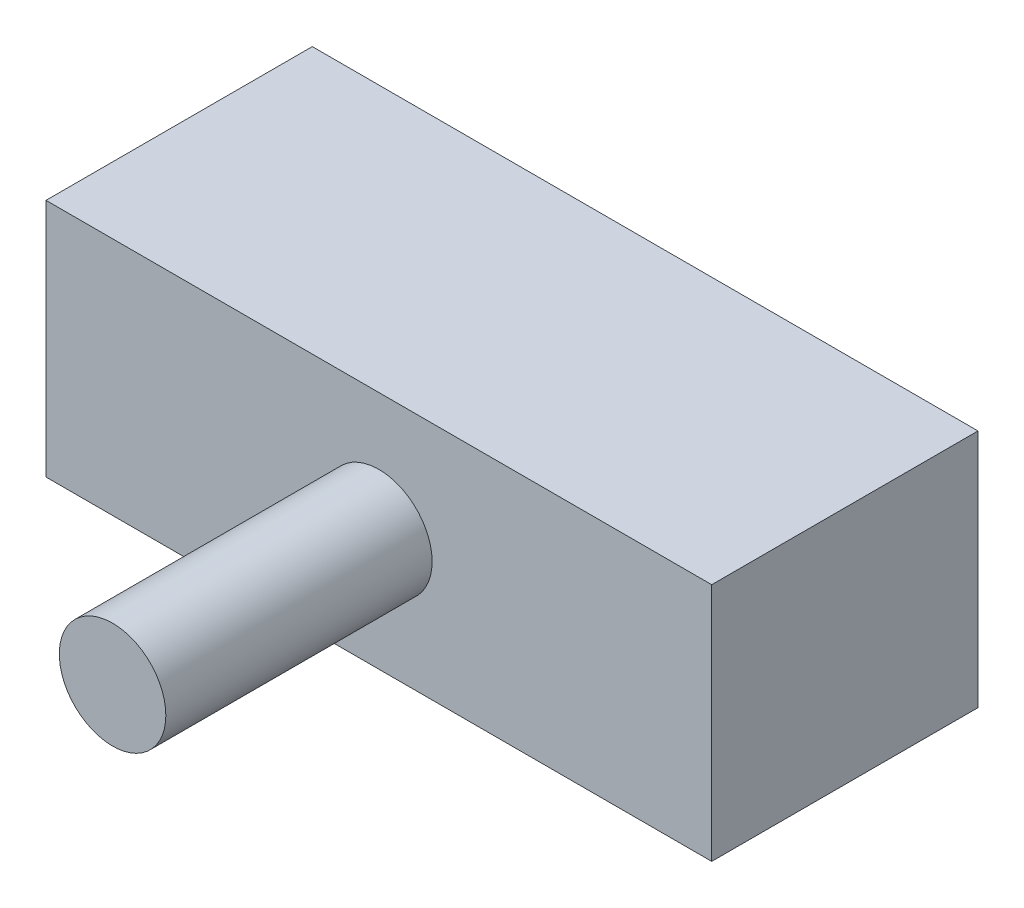
ISO-10303-21;
HEADER;
FILE_DESCRIPTION(('STEP AP214'),'2;1');
FILE_NAME('part.step','',(''),(''),'','','');
FILE_SCHEMA(('AUTOMOTIVE_DESIGN { 1 0 10303 214 1 1 1 1 }'));
ENDSEC;
DATA;
#1=APPLICATION_CONTEXT('core data for automotive mechanical design processes');
#2=APPLICATION_PROTOCOL_DEFINITION('international standard','automotive_design',2000,#1);
#3=PRODUCT_CONTEXT('',#1,'mechanical');
#4=PRODUCT('Part','Part','',(#3));
#5=PRODUCT_RELATED_PRODUCT_CATEGORY('part','',(#4));
#6=PRODUCT_DEFINITION_FORMATION('','',#4);
#7=PRODUCT_DEFINITION_CONTEXT('part definition',#1,'design');
#8=PRODUCT_DEFINITION('design','',#6,#7);
#9=PRODUCT_DEFINITION_SHAPE('','',#8);
#10=(LENGTH_UNIT() NAMED_UNIT(*) SI_UNIT(.MILLI.,.METRE.));
#11=(NAMED_UNIT(*) PLANE_ANGLE_UNIT() SI_UNIT($,.RADIAN.));
#12=(NAMED_UNIT(*) SI_UNIT($,.STERADIAN.) SOLID_ANGLE_UNIT());
#13=UNCERTAINTY_MEASURE_WITH_UNIT(LENGTH_MEASURE(1.E-05),#10,'distance_accuracy_value','');
#14=(GEOMETRIC_REPRESENTATION_CONTEXT(3) GLOBAL_UNCERTAINTY_ASSIGNED_CONTEXT((#13)) GLOBAL_UNIT_ASSIGNED_CONTEXT((#10,
#11,#12)) REPRESENTATION_CONTEXT('',''));
#15=CARTESIAN_POINT('',(0.,0.,0.));
#16=DIRECTION('',(0.,0.,1.));
#17=DIRECTION('',(1.,0.,0.));
#18=AXIS2_PLACEMENT_3D('',#15,#16,#17);
#19=CARTESIAN_POINT('',(12.5,4.5,10.));
#20=DIRECTION('',(-1.,0.,0.));
#21=DIRECTION('',(0.,0.,1.));
#22=AXIS2_PLACEMENT_3D('',#19,#20,#21);
#23=PLANE('',#22);
#24=DIRECTION('',(0.,1.,0.));
#25=VECTOR('',#24,1.);
#26=CARTESIAN_POINT('',(12.5,4.5,0.));
#27=LINE('',#26,#25);
#28=CARTESIAN_POINT('',(12.5,-4.5,0.));
#29=VERTEX_POINT('',#28);
#30=CARTESIAN_POINT('',(12.5,4.5,0.));
#31=VERTEX_POINT('',#30);
#32=EDGE_CURVE('E110',#29,#31,#27,.T.);
#33=ORIENTED_EDGE('',*,*,#32,.T.);
#34=DIRECTION('',(0.,0.,-1.));
#35=VECTOR('',#34,1.);
#36=CARTESIAN_POINT('',(12.5,4.5,10.));
#37=LINE('',#36,#35);
#38=CARTESIAN_POINT('',(12.5,4.5,10.));
#39=VERTEX_POINT('',#38);
#40=EDGE_CURVE('E42',#39,#31,#37,.T.);
#41=ORIENTED_EDGE('',*,*,#40,.F.);
#42=DIRECTION('',(0.,1.,0.));
#43=VECTOR('',#42,1.);
#44=CARTESIAN_POINT('',(12.5,4.5,10.));
#45=LINE('',#44,#43);
#46=CARTESIAN_POINT('',(12.5,-4.5,10.));
#47=VERTEX_POINT('',#46);
#48=EDGE_CURVE('E93',#47,#39,#45,.T.);
#49=ORIENTED_EDGE('',*,*,#48,.F.);
#50=DIRECTION('',(0.,0.,-1.));
#51=VECTOR('',#50,1.);
#52=CARTESIAN_POINT('',(12.5,-4.5,10.));
#53=LINE('',#52,#51);
#54=EDGE_CURVE('E106',#47,#29,#53,.T.);
#55=ORIENTED_EDGE('',*,*,#54,.T.);
#56=EDGE_LOOP('',(#33,#41,#49,#55));
#57=FACE_BOUND('',#56,.T.);
#58=ADVANCED_FACE('F39',(#57),#23,.F.);
#59=CARTESIAN_POINT('',(-12.5,4.5,10.));
#60=DIRECTION('',(0.,-1.,0.));
#61=DIRECTION('',(0.,0.,-1.));
#62=AXIS2_PLACEMENT_3D('',#59,#60,#61);
#63=PLANE('',#62);
#64=DIRECTION('',(-1.,0.,0.));
#65=VECTOR('',#64,1.);
#66=CARTESIAN_POINT('',(-12.5,4.5,0.));
#67=LINE('',#66,#65);
#68=CARTESIAN_POINT('',(-12.5,4.5,0.));
#69=VERTEX_POINT('',#68);
#70=EDGE_CURVE('E99',#31,#69,#67,.T.);
#71=ORIENTED_EDGE('',*,*,#70,.T.);
#72=DIRECTION('',(0.,0.,-1.));
#73=VECTOR('',#72,1.);
#74=CARTESIAN_POINT('',(-12.5,4.5,10.));
#75=LINE('',#74,#73);
#76=CARTESIAN_POINT('',(-12.5,4.5,10.));
#77=VERTEX_POINT('',#76);
#78=EDGE_CURVE('E97',#77,#69,#75,.T.);
#79=ORIENTED_EDGE('',*,*,#78,.F.);
#80=DIRECTION('',(-1.,0.,0.));
#81=VECTOR('',#80,1.);
#82=CARTESIAN_POINT('',(-12.5,4.5,10.));
#83=LINE('',#82,#81);
#84=EDGE_CURVE('E88',#39,#77,#83,.T.);
#85=ORIENTED_EDGE('',*,*,#84,.F.);
#86=ORIENTED_EDGE('',*,*,#40,.T.);
#87=EDGE_LOOP('',(#71,#79,#85,#86));
#88=FACE_BOUND('',#87,.T.);
#89=ADVANCED_FACE('F98',(#88),#63,.F.);
#90=CARTESIAN_POINT('',(-12.5,4.5,10.));
#91=DIRECTION('',(1.,0.,0.));
#92=DIRECTION('',(0.,0.,-1.));
#93=AXIS2_PLACEMENT_3D('',#90,#91,#92);
#94=PLANE('',#93);
#95=DIRECTION('',(0.,-1.,0.));
#96=VECTOR('',#95,1.);
#97=CARTESIAN_POINT('',(-12.5,4.5,0.));
#98=LINE('',#97,#96);
#99=CARTESIAN_POINT('',(-12.5,-4.5,0.));
#100=VERTEX_POINT('',#99);
#101=EDGE_CURVE('E74',#69,#100,#98,.T.);
#102=ORIENTED_EDGE('',*,*,#101,.T.);
#103=DIRECTION('',(0.,0.,-1.));
#104=VECTOR('',#103,1.);
#105=CARTESIAN_POINT('',(-12.5,-4.5,10.));
#106=LINE('',#105,#104);
#107=CARTESIAN_POINT('',(-12.5,-4.5,10.));
#108=VERTEX_POINT('',#107);
#109=EDGE_CURVE('E101',#108,#100,#106,.T.);
#110=ORIENTED_EDGE('',*,*,#109,.F.);
#111=DIRECTION('',(0.,-1.,0.));
#112=VECTOR('',#111,1.);
#113=CARTESIAN_POINT('',(-12.5,4.5,10.));
#114=LINE('',#113,#112);
#115=EDGE_CURVE('E91',#77,#108,#114,.T.);
#116=ORIENTED_EDGE('',*,*,#115,.F.);
#117=ORIENTED_EDGE('',*,*,#78,.T.);
#118=EDGE_LOOP('',(#102,#110,#116,#117));
#119=FACE_BOUND('',#118,.T.);
#120=ADVANCED_FACE('F102',(#119),#94,.F.);
#121=CARTESIAN_POINT('',(-12.5,-4.5,10.));
#122=DIRECTION('',(0.,1.,0.));
#123=DIRECTION('',(0.,0.,1.));
#124=AXIS2_PLACEMENT_3D('',#121,#122,#123);
#125=PLANE('',#124);
#126=DIRECTION('',(1.,0.,0.));
#127=VECTOR('',#126,1.);
#128=CARTESIAN_POINT('',(-12.5,-4.5,0.));
#129=LINE('',#128,#127);
#130=EDGE_CURVE('E80',#100,#29,#129,.T.);
#131=ORIENTED_EDGE('',*,*,#130,.T.);
#132=ORIENTED_EDGE('',*,*,#54,.F.);
#133=DIRECTION('',(1.,0.,0.));
#134=VECTOR('',#133,1.);
#135=CARTESIAN_POINT('',(-12.5,-4.5,10.));
#136=LINE('',#135,#134);
#137=EDGE_CURVE('E57',#108,#47,#136,.T.);
#138=ORIENTED_EDGE('',*,*,#137,.F.);
#139=ORIENTED_EDGE('',*,*,#109,.T.);
#140=EDGE_LOOP('',(#131,#132,#138,#139));
#141=FACE_BOUND('',#140,.T.);
#142=ADVANCED_FACE('F124',(#141),#125,.F.);
#143=CARTESIAN_POINT('',(0.,0.,10.));
#144=DIRECTION('',(0.,0.,1.));
#145=DIRECTION('',(1.,0.,0.));
#146=AXIS2_PLACEMENT_3D('',#143,#144,#145);
#147=PLANE('',#146);
#148=CARTESIAN_POINT('',(0.,0.,10.));
#149=DIRECTION('',(0.,0.,1.));
#150=DIRECTION('',(1.,0.,0.));
#151=AXIS2_PLACEMENT_3D('',#148,#149,#150);
#152=CIRCLE('',#151,2.);
#153=CARTESIAN_POINT('',(2.,0.,10.));
#154=VERTEX_POINT('',#153);
#155=EDGE_CURVE('E11',#154,#154,#152,.T.);
#156=ORIENTED_EDGE('',*,*,#155,.F.);
#157=EDGE_LOOP('',(#156));
#158=FACE_BOUND('',#157,.T.);
#159=ORIENTED_EDGE('',*,*,#48,.T.);
#160=ORIENTED_EDGE('',*,*,#84,.T.);
#161=ORIENTED_EDGE('',*,*,#115,.T.);
#162=ORIENTED_EDGE('',*,*,#137,.T.);
#163=EDGE_LOOP('',(#159,#160,#161,#162));
#164=FACE_BOUND('',#163,.T.);
#165=ADVANCED_FACE('F89',(#158,#164),#147,.T.);
#166=CARTESIAN_POINT('',(0.,0.,0.));
#167=DIRECTION('',(0.,0.,1.));
#168=DIRECTION('',(1.,0.,0.));
#169=AXIS2_PLACEMENT_3D('',#166,#167,#168);
#170=PLANE('',#169);
#171=ORIENTED_EDGE('',*,*,#32,.F.);
#172=ORIENTED_EDGE('',*,*,#130,.F.);
#173=ORIENTED_EDGE('',*,*,#101,.F.);
#174=ORIENTED_EDGE('',*,*,#70,.F.);
#175=EDGE_LOOP('',(#171,#172,#173,#174));
#176=FACE_BOUND('',#175,.T.);
#177=ADVANCED_FACE('F127',(#176),#170,.F.);
#178=CARTESIAN_POINT('',(0.,0.,20.));
#179=DIRECTION('',(0.,0.,-1.));
#180=DIRECTION('',(-1.,0.,0.));
#181=AXIS2_PLACEMENT_3D('',#178,#179,#180);
#182=CYLINDRICAL_SURFACE('',#181,2.);
#183=CARTESIAN_POINT('',(0.,0.,20.));
#184=DIRECTION('',(0.,0.,1.));
#185=DIRECTION('',(1.,0.,0.));
#186=AXIS2_PLACEMENT_3D('',#183,#184,#185);
#187=CIRCLE('',#186,2.);
#188=CARTESIAN_POINT('',(2.,0.,20.));
#189=VERTEX_POINT('',#188);
#190=EDGE_CURVE('E114',#189,#189,#187,.T.);
#191=ORIENTED_EDGE('',*,*,#190,.F.);
#192=EDGE_LOOP('',(#191));
#193=FACE_BOUND('',#192,.T.);
#194=ORIENTED_EDGE('',*,*,#155,.T.);
#195=EDGE_LOOP('',(#194));
#196=FACE_BOUND('',#195,.T.);
#197=ADVANCED_FACE('F137',(#193,#196),#182,.T.);
#198=CARTESIAN_POINT('',(0.,0.,20.));
#199=DIRECTION('',(0.,0.,1.));
#200=DIRECTION('',(1.,0.,0.));
#201=AXIS2_PLACEMENT_3D('',#198,#199,#200);
#202=PLANE('',#201);
#203=ORIENTED_EDGE('',*,*,#190,.T.);
#204=EDGE_LOOP('',(#203));
#205=FACE_BOUND('',#204,.T.);
#206=ADVANCED_FACE('F135',(#205),#202,.T.);
#207=CLOSED_SHELL('',(#58,#89,#120,#142,#165,#177,#197,#206));
#208=MANIFOLD_SOLID_BREP('B2',#207);
#209=ADVANCED_BREP_SHAPE_REPRESENTATION('',(#18,#208),#14);
#210=SHAPE_DEFINITION_REPRESENTATION(#9,#209);
ENDSEC;
END-ISO-10303-21;
